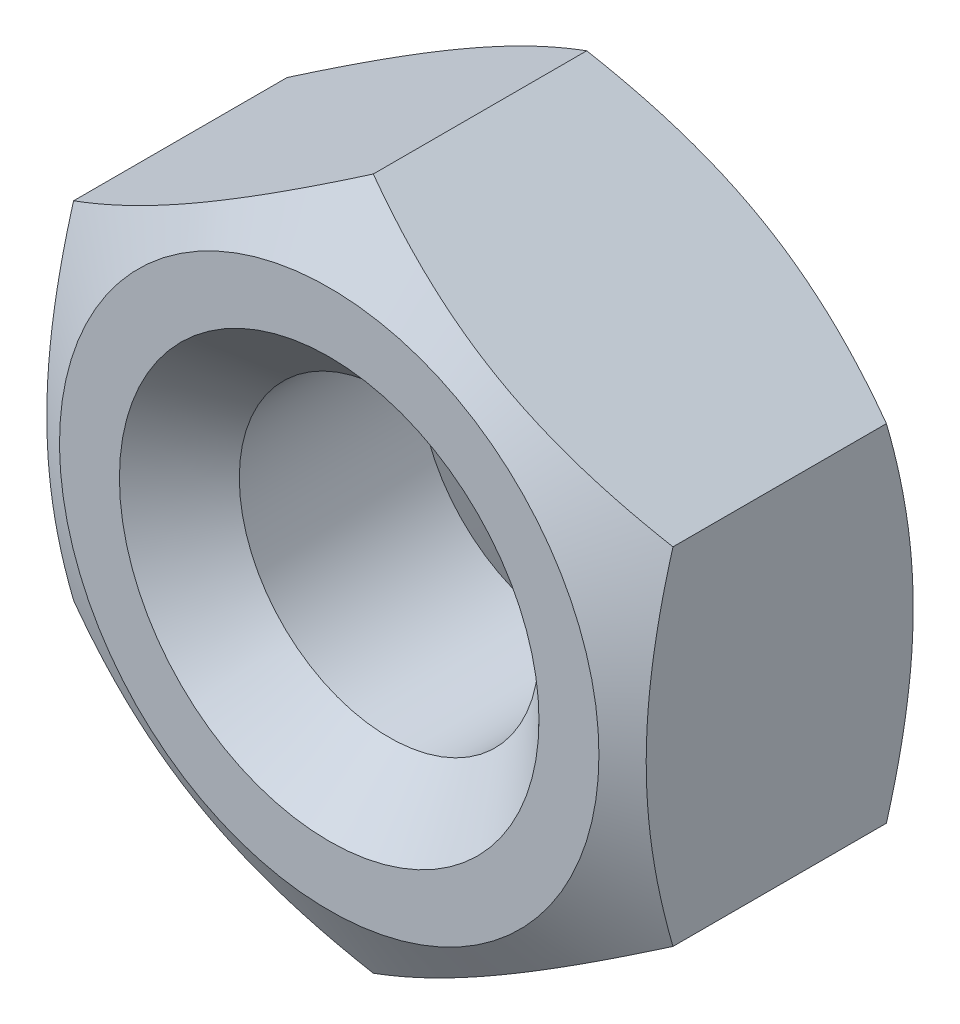
ISO-10303-21;
HEADER;
FILE_DESCRIPTION(('STEP AP214'),'2;1');
FILE_NAME('part.step','',(''),(''),'','','');
FILE_SCHEMA(('AUTOMOTIVE_DESIGN { 1 0 10303 214 1 1 1 1 }'));
ENDSEC;
DATA;
#1=APPLICATION_CONTEXT('core data for automotive mechanical design processes');
#2=APPLICATION_PROTOCOL_DEFINITION('international standard','automotive_design',2000,#1);
#3=PRODUCT_CONTEXT('',#1,'mechanical');
#4=PRODUCT('Part','Part','',(#3));
#5=PRODUCT_RELATED_PRODUCT_CATEGORY('part','',(#4));
#6=PRODUCT_DEFINITION_FORMATION('','',#4);
#7=PRODUCT_DEFINITION_CONTEXT('part definition',#1,'design');
#8=PRODUCT_DEFINITION('design','',#6,#7);
#9=PRODUCT_DEFINITION_SHAPE('','',#8);
#10=(LENGTH_UNIT() NAMED_UNIT(*) SI_UNIT(.MILLI.,.METRE.));
#11=(NAMED_UNIT(*) PLANE_ANGLE_UNIT() SI_UNIT($,.RADIAN.));
#12=(NAMED_UNIT(*) SI_UNIT($,.STERADIAN.) SOLID_ANGLE_UNIT());
#13=UNCERTAINTY_MEASURE_WITH_UNIT(LENGTH_MEASURE(1.E-05),#10,'distance_accuracy_value','');
#14=(GEOMETRIC_REPRESENTATION_CONTEXT(3) GLOBAL_UNCERTAINTY_ASSIGNED_CONTEXT((#13)) GLOBAL_UNIT_ASSIGNED_CONTEXT((#10,
#11,#12)) REPRESENTATION_CONTEXT('',''));
#15=CARTESIAN_POINT('',(0.,0.,0.));
#16=DIRECTION('',(0.,0.,1.));
#17=DIRECTION('',(1.,0.,0.));
#18=AXIS2_PLACEMENT_3D('',#15,#16,#17);
#19=CARTESIAN_POINT('',(0.,0.,0.));
#20=DIRECTION('',(0.,0.,-1.));
#21=DIRECTION('',(-1.,0.,0.));
#22=AXIS2_PLACEMENT_3D('',#19,#20,#21);
#23=PLANE('',#22);
#24=CARTESIAN_POINT('',(0.,0.,0.));
#25=DIRECTION('',(0.,0.,-1.));
#26=DIRECTION('',(-1.,0.,0.));
#27=AXIS2_PLACEMENT_3D('',#24,#25,#26);
#28=CIRCLE('',#27,1.4);
#29=CARTESIAN_POINT('',(-1.4,0.,0.));
#30=VERTEX_POINT('',#29);
#31=EDGE_CURVE('E110',#30,#30,#28,.T.);
#32=ORIENTED_EDGE('',*,*,#31,.T.);
#33=EDGE_LOOP('',(#32));
#34=FACE_BOUND('',#33,.T.);
#35=CARTESIAN_POINT('',(0.,0.,0.));
#36=DIRECTION('',(0.,0.,1.));
#37=DIRECTION('',(1.,0.,0.));
#38=AXIS2_PLACEMENT_3D('',#35,#36,#37);
#39=CIRCLE('',#38,1.8);
#40=CARTESIAN_POINT('',(1.8,0.,0.));
#41=VERTEX_POINT('',#40);
#42=EDGE_CURVE('E134',#41,#41,#39,.T.);
#43=ORIENTED_EDGE('',*,*,#42,.T.);
#44=EDGE_LOOP('',(#43));
#45=FACE_BOUND('',#44,.T.);
#46=ADVANCED_FACE('F36',(#34,#45),#23,.F.);
#47=CARTESIAN_POINT('',(0.,0.,-2.));
#48=DIRECTION('',(0.,0.,1.));
#49=DIRECTION('',(1.,0.,0.));
#50=AXIS2_PLACEMENT_3D('',#47,#48,#49);
#51=PLANE('',#50);
#52=CARTESIAN_POINT('',(0.,0.,-2.));
#53=DIRECTION('',(0.,0.,1.));
#54=DIRECTION('',(1.,0.,0.));
#55=AXIS2_PLACEMENT_3D('',#52,#53,#54);
#56=CIRCLE('',#55,1.4);
#57=CARTESIAN_POINT('',(1.4,0.,-2.));
#58=VERTEX_POINT('',#57);
#59=EDGE_CURVE('E12',#58,#58,#56,.T.);
#60=ORIENTED_EDGE('',*,*,#59,.T.);
#61=EDGE_LOOP('',(#60));
#62=FACE_BOUND('',#61,.T.);
#63=CARTESIAN_POINT('',(0.,0.,-2.));
#64=DIRECTION('',(0.,0.,1.));
#65=DIRECTION('',(1.,0.,0.));
#66=AXIS2_PLACEMENT_3D('',#63,#64,#65);
#67=CIRCLE('',#66,1.82171423220702);
#68=CARTESIAN_POINT('',(1.82171423220702,0.,-2.));
#69=VERTEX_POINT('',#68);
#70=EDGE_CURVE('E96',#69,#69,#67,.T.);
#71=ORIENTED_EDGE('',*,*,#70,.F.);
#72=EDGE_LOOP('',(#71));
#73=FACE_BOUND('',#72,.T.);
#74=ADVANCED_FACE('F227',(#62,#73),#51,.F.);
#75=CARTESIAN_POINT('',(0.,0.,-2.));
#76=DIRECTION('',(0.,0.,1.));
#77=DIRECTION('',(1.,0.,0.));
#78=AXIS2_PLACEMENT_3D('',#75,#76,#77);
#79=CYLINDRICAL_SURFACE('',#78,1.);
#80=CARTESIAN_POINT('',(0.,0.,-0.400000000000001));
#81=DIRECTION('',(0.,0.,-1.));
#82=DIRECTION('',(-1.,0.,0.));
#83=AXIS2_PLACEMENT_3D('',#80,#81,#82);
#84=CIRCLE('',#83,1.);
#85=CARTESIAN_POINT('',(-1.,0.,-0.400000000000001));
#86=VERTEX_POINT('',#85);
#87=EDGE_CURVE('E44',#86,#86,#84,.F.);
#88=ORIENTED_EDGE('',*,*,#87,.T.);
#89=EDGE_LOOP('',(#88));
#90=FACE_BOUND('',#89,.T.);
#91=CARTESIAN_POINT('',(0.,0.,-1.6));
#92=DIRECTION('',(0.,0.,1.));
#93=DIRECTION('',(1.,0.,0.));
#94=AXIS2_PLACEMENT_3D('',#91,#92,#93);
#95=CIRCLE('',#94,1.);
#96=CARTESIAN_POINT('',(1.,0.,-1.6));
#97=VERTEX_POINT('',#96);
#98=EDGE_CURVE('E252',#97,#97,#95,.F.);
#99=ORIENTED_EDGE('',*,*,#98,.T.);
#100=EDGE_LOOP('',(#99));
#101=FACE_BOUND('',#100,.T.);
#102=ADVANCED_FACE('F224',(#90,#101),#79,.F.);
#103=CARTESIAN_POINT('',(0.,0.,-1.71411308176974));
#104=DIRECTION('',(0.,0.,1.));
#105=DIRECTION('',(1.,0.,0.));
#106=AXIS2_PLACEMENT_3D('',#103,#104,#105);
#107=CONICAL_SURFACE('',#106,2.31688489980112,1.0471975511966);
#108=CARTESIAN_POINT('',(-0.000199999999999981,-2.30951654681234,-1.71836719735155));
#109=CARTESIAN_POINT('',(0.08769126290006,-2.25877250251758,-1.74767712787136));
#110=CARTESIAN_POINT('',(0.176341194473591,-2.20759044065996,-1.77433381199158));
#111=CARTESIAN_POINT('',(0.355176246997802,-2.10433997494456,-1.82086417295132));
#112=CARTESIAN_POINT('',(0.445364546505037,-2.05226973594631,-1.84072138758926));
#113=CARTESIAN_POINT('',(0.624623385763306,-1.94877459684592,-1.87163319994879));
#114=CARTESIAN_POINT('',(0.713666338226304,-1.89736562427197,-1.88289351237351));
#115=CARTESIAN_POINT('',(0.892171397785043,-1.79430568008402,-1.8963380013774));
#116=CARTESIAN_POINT('',(0.981632855703959,-1.74265508327244,-1.89853330901858));
#117=CARTESIAN_POINT('',(1.1488083535488,-1.64613626458981,-1.8939756746414));
#118=CARTESIAN_POINT('',(1.22654737026578,-1.60125362236173,-1.88834178928503));
#119=CARTESIAN_POINT('',(1.38151891453613,-1.51178075956051,-1.87048276871122));
#120=CARTESIAN_POINT('',(1.4587509057412,-1.46719084864821,-1.8582515279486));
#121=CARTESIAN_POINT('',(1.6140421864822,-1.37753338590959,-1.82767322710443));
#122=CARTESIAN_POINT('',(1.69208181310738,-1.33247718647009,-1.80919649690633));
#123=CARTESIAN_POINT('',(1.84699686569213,-1.24303693915875,-1.76726114575919));
#124=CARTESIAN_POINT('',(1.92387427762312,-1.1986517446858,-1.74381238347973));
#125=CARTESIAN_POINT('',(2.0002,-1.15458506832541,-1.71836719735155));
#126=B_SPLINE_CURVE_WITH_KNOTS('',3,(#108,#109,#110,#111,#112,#113,#114,#115,#116,#117,#118,
#119,#120,#121,#122,#123,#124,#125),.UNSPECIFIED.,.F.,.F.,(4,2,2,2,2,2,2,2,4),(0.,
0.31703182469561,0.634825876346564,0.944753967652636,1.25430138000371,1.52387047293094,
1.79368946861028,2.06949491027634,2.34475850821472),.UNSPECIFIED.);
#127=CARTESIAN_POINT('',(0.,-2.3094010767585,-1.71843386901796));
#128=VERTEX_POINT('',#127);
#129=CARTESIAN_POINT('',(2.,-1.15470053837925,-1.71843386901796));
#130=VERTEX_POINT('',#129);
#131=EDGE_CURVE('E86',#128,#130,#126,.T.);
#132=ORIENTED_EDGE('',*,*,#131,.F.);
#133=CARTESIAN_POINT('',(-2.0002,-1.15458506832541,-1.71836719735155));
#134=CARTESIAN_POINT('',(-1.91230873709994,-1.20532911262018,-1.74767712787136));
#135=CARTESIAN_POINT('',(-1.82365880552641,-1.2565111744778,-1.77433381199158));
#136=CARTESIAN_POINT('',(-1.6448237530022,-1.35976164019319,-1.82086417295132));
#137=CARTESIAN_POINT('',(-1.55463545349496,-1.41183187919145,-1.84072138758926));
#138=CARTESIAN_POINT('',(-1.37537661423669,-1.51532701829183,-1.87163319994879));
#139=CARTESIAN_POINT('',(-1.2863336617737,-1.56673599086578,-1.88289351237351));
#140=CARTESIAN_POINT('',(-1.10782860221496,-1.66979593505373,-1.8963380013774));
#141=CARTESIAN_POINT('',(-1.01836714429604,-1.72144653186531,-1.89853330901858));
#142=CARTESIAN_POINT('',(-0.851191646451202,-1.81796535054794,-1.8939756746414));
#143=CARTESIAN_POINT('',(-0.773452629734216,-1.86284799277603,-1.88834178928503));
#144=CARTESIAN_POINT('',(-0.618481085463867,-1.95232085557725,-1.87048276871122));
#145=CARTESIAN_POINT('',(-0.541249094258802,-1.99691076648954,-1.8582515279486));
#146=CARTESIAN_POINT('',(-0.385957813517799,-2.08656822922816,-1.82767322710443));
#147=CARTESIAN_POINT('',(-0.30791818689262,-2.13162442866767,-1.80919649690633));
#148=CARTESIAN_POINT('',(-0.153003134307865,-2.221064675979,-1.76726114575919));
#149=CARTESIAN_POINT('',(-0.07612572237688,-2.26544987045196,-1.74381238347973));
#150=CARTESIAN_POINT('',(0.00020000000000012,-2.30951654681234,-1.71836719735155));
#151=B_SPLINE_CURVE_WITH_KNOTS('',3,(#133,#134,#135,#136,#137,#138,#139,#140,#141,#142,#143,
#144,#145,#146,#147,#148,#149,#150),.UNSPECIFIED.,.F.,.F.,(4,2,2,2,2,2,2,2,4),(0.,
0.31703182469561,0.634825876346564,0.944753967652636,1.25430138000371,1.52387047293094,
1.79368946861028,2.06949491027634,2.34475850821472),.UNSPECIFIED.);
#152=CARTESIAN_POINT('',(-2.,-1.15470053837925,-1.71843386901796));
#153=VERTEX_POINT('',#152);
#154=EDGE_CURVE('E90',#153,#128,#151,.T.);
#155=ORIENTED_EDGE('',*,*,#154,.F.);
#156=CARTESIAN_POINT('',(-2.,-3.04877948093373,-0.946610333820865));
#157=CARTESIAN_POINT('',(-2.,-2.96185159302541,-0.988562645387252));
#158=CARTESIAN_POINT('',(-2.,-2.87471836280849,-1.03009706688648));
#159=CARTESIAN_POINT('',(-2.,-2.69993179487877,-1.11209394762808));
#160=CARTESIAN_POINT('',(-2.,-2.61227837269937,-1.15255622660877));
#161=CARTESIAN_POINT('',(-2.,-2.43586446250616,-1.2323876711059));
#162=CARTESIAN_POINT('',(-2.,-2.34710050602697,-1.27174919950666));
#163=CARTESIAN_POINT('',(-2.,-2.16884774611023,-1.34878895599142));
#164=CARTESIAN_POINT('',(-2.,-2.07935897883648,-1.38646726745433));
#165=CARTESIAN_POINT('',(-2.,-1.89684612368223,-1.46078073979269));
#166=CARTESIAN_POINT('',(-2.,-1.80379584053042,-1.49735193001217));
#167=CARTESIAN_POINT('',(-2.,-1.61658729640833,-1.56759613655673));
#168=CARTESIAN_POINT('',(-2.,-1.52242890974947,-1.60126882044102));
#169=CARTESIAN_POINT('',(-2.,-1.33305239823237,-1.66479173891702));
#170=CARTESIAN_POINT('',(-2.,-1.23783711186187,-1.69465034756398));
#171=CARTESIAN_POINT('',(-2.,-1.04603435310176,-1.74955651897636));
#172=CARTESIAN_POINT('',(-2.,-0.949447219988647,-1.7746052497828));
#173=CARTESIAN_POINT('',(-2.,-0.755378801303309,-1.81852205456775));
#174=CARTESIAN_POINT('',(-2.,-0.657904763924989,-1.83742154973516));
#175=CARTESIAN_POINT('',(-2.,-0.461802968613701,-1.86793678414789));
#176=CARTESIAN_POINT('',(-2.,-0.363175303970167,-1.87955310826374));
#177=CARTESIAN_POINT('',(-2.,-0.166520324172816,-1.89441942436761));
#178=CARTESIAN_POINT('',(-2.,-0.0685010507901018,-1.89777276508989));
#179=CARTESIAN_POINT('',(-2.,0.127462263079516,-1.89610968722588));
#180=CARTESIAN_POINT('',(-2.,0.225406300837787,-1.89109297820224));
#181=CARTESIAN_POINT('',(-2.,0.463635287558364,-1.86915306792847));
#182=CARTESIAN_POINT('',(-2.,0.603527867989527,-1.84795196594647));
#183=CARTESIAN_POINT('',(-2.,0.880665760437669,-1.79233049354238));
#184=CARTESIAN_POINT('',(-2.,1.01790818531803,-1.75789647574453));
#185=CARTESIAN_POINT('',(-2.,1.29251747186684,-1.6786758790534));
#186=CARTESIAN_POINT('',(-2.,1.42982276293823,-1.63368140465588));
#187=CARTESIAN_POINT('',(-2.,1.70189717318541,-1.53684147910921));
#188=CARTESIAN_POINT('',(-2.,1.8366670790957,-1.48499819459513));
#189=CARTESIAN_POINT('',(-2.,2.14157601730041,-1.36145713939248));
#190=CARTESIAN_POINT('',(-2.,2.31109893174722,-1.28825401541372));
#191=CARTESIAN_POINT('',(-2.,2.64792466737481,-1.13687878574264));
#192=CARTESIAN_POINT('',(-2.,2.81522699494853,-1.05870559691183));
#193=CARTESIAN_POINT('',(-2.,3.14837482364043,-0.898965541238145));
#194=CARTESIAN_POINT('',(-2.,3.31421892978584,-0.817395779382536));
#195=CARTESIAN_POINT('',(-2.,3.64475106371024,-0.651944579241605));
#196=CARTESIAN_POINT('',(-2.,3.80943905699779,-0.568063072352403));
#197=CARTESIAN_POINT('',(-2.,4.12519667487026,-0.405220881919118));
#198=CARTESIAN_POINT('',(-2.,4.27633037467361,-0.326384133779491));
#199=CARTESIAN_POINT('',(-2.,4.57803864607621,-0.167638980395725));
#200=CARTESIAN_POINT('',(-2.,4.72861320162548,-0.087730544688302));
#201=CARTESIAN_POINT('',(-2.,5.02899932412339,0.0727373508397198));
#202=CARTESIAN_POINT('',(-2.,5.17881183492632,0.153295046204304));
#203=CARTESIAN_POINT('',(-2.,5.47807583326341,0.315061569844154));
#204=CARTESIAN_POINT('',(-2.,5.62752733765088,0.396270366927683));
#205=CARTESIAN_POINT('',(-2.,5.77684422474792,0.477724224516672));
#206=B_SPLINE_CURVE_WITH_KNOTS('',3,(#156,#157,#158,#159,#160,#161,#162,#163,#164,#165,#166,
#167,#168,#169,#170,#171,#172,#173,#174,#175,#176,#177,#178,#179,#180,#181,#182,#183,#184,#185,
#186,#187,#188,#189,#190,#191,#192,#193,#194,#195,#196,#197,#198,#199,#200,#201,#202,#203,#204,
#205),.UNSPECIFIED.,.F.,.F.,(4,2,2,2,2,2,2,2,2,2,2,2,2,2,2,2,2,2,2,2,2,2,2,2,4),(0.,
0.289569150407998,0.579186681700231,0.870472101785877,1.16174307688205,1.46164289263703,
1.76157705934612,2.06084094803636,2.36003207067926,2.65766946686969,2.95528295841164,
3.24915473419224,3.54303670741721,3.96663033727491,4.39066200536735,4.82386929648856,
5.2569398683205,5.8107662015206,6.36471364795495,6.91914331471273,7.47358945260821,
7.98496425619282,8.49635362681464,9.00664588787394,9.51691384718108),.UNSPECIFIED.);
#207=CARTESIAN_POINT('',(-2.,1.15470053837925,-1.71843386901796));
#208=VERTEX_POINT('',#207);
#209=EDGE_CURVE('E105',#208,#153,#206,.F.);
#210=ORIENTED_EDGE('',*,*,#209,.F.);
#211=CARTESIAN_POINT('',(0.000199999999999994,2.30951654681234,-1.71836719735155));
#212=CARTESIAN_POINT('',(-0.0876912629000599,2.25877250251758,-1.74767712787136));
#213=CARTESIAN_POINT('',(-0.176341194473591,2.20759044065996,-1.77433381199158));
#214=CARTESIAN_POINT('',(-0.355176246997802,2.10433997494456,-1.82086417295132));
#215=CARTESIAN_POINT('',(-0.445364546505037,2.05226973594631,-1.84072138758926));
#216=CARTESIAN_POINT('',(-0.624623385763306,1.94877459684592,-1.87163319994879));
#217=CARTESIAN_POINT('',(-0.713666338226304,1.89736562427197,-1.88289351237351));
#218=CARTESIAN_POINT('',(-0.892171397785043,1.79430568008402,-1.8963380013774));
#219=CARTESIAN_POINT('',(-0.981632855703959,1.74265508327244,-1.89853330901858));
#220=CARTESIAN_POINT('',(-1.1488083535488,1.64613626458981,-1.8939756746414));
#221=CARTESIAN_POINT('',(-1.22654737026578,1.60125362236173,-1.88834178928503));
#222=CARTESIAN_POINT('',(-1.38151891453613,1.51178075956051,-1.87048276871122));
#223=CARTESIAN_POINT('',(-1.4587509057412,1.46719084864821,-1.8582515279486));
#224=CARTESIAN_POINT('',(-1.6140421864822,1.37753338590959,-1.82767322710443));
#225=CARTESIAN_POINT('',(-1.69208181310738,1.33247718647009,-1.80919649690633));
#226=CARTESIAN_POINT('',(-1.84699686569213,1.24303693915875,-1.76726114575919));
#227=CARTESIAN_POINT('',(-1.92387427762312,1.1986517446858,-1.74381238347973));
#228=CARTESIAN_POINT('',(-2.0002,1.15458506832541,-1.71836719735155));
#229=B_SPLINE_CURVE_WITH_KNOTS('',3,(#211,#212,#213,#214,#215,#216,#217,#218,#219,#220,#221,
#222,#223,#224,#225,#226,#227,#228),.UNSPECIFIED.,.F.,.F.,(4,2,2,2,2,2,2,2,4),(0.,
0.31703182469561,0.634825876346564,0.944753967652636,1.25430138000371,1.52387047293094,
1.79368946861028,2.06949491027634,2.34475850821472),.UNSPECIFIED.);
#230=CARTESIAN_POINT('',(0.,2.3094010767585,-1.71843386901796));
#231=VERTEX_POINT('',#230);
#232=EDGE_CURVE('E195',#231,#208,#229,.T.);
#233=ORIENTED_EDGE('',*,*,#232,.F.);
#234=CARTESIAN_POINT('',(2.0002,1.15458506832541,-1.71836719735155));
#235=CARTESIAN_POINT('',(1.91230873709994,1.20532911262018,-1.74767712787137));
#236=CARTESIAN_POINT('',(1.82365880552641,1.2565111744778,-1.77433381199158));
#237=CARTESIAN_POINT('',(1.6448237530022,1.35976164019319,-1.82086417295132));
#238=CARTESIAN_POINT('',(1.55463545349496,1.41183187919145,-1.84072138758926));
#239=CARTESIAN_POINT('',(1.37537661423669,1.51532701829183,-1.87163319994879));
#240=CARTESIAN_POINT('',(1.2863336617737,1.56673599086578,-1.88289351237351));
#241=CARTESIAN_POINT('',(1.10782860221496,1.66979593505373,-1.8963380013774));
#242=CARTESIAN_POINT('',(1.01836714429604,1.72144653186531,-1.89853330901858));
#243=CARTESIAN_POINT('',(0.851191646451202,1.81796535054794,-1.8939756746414));
#244=CARTESIAN_POINT('',(0.773452629734216,1.86284799277603,-1.88834178928503));
#245=CARTESIAN_POINT('',(0.618481085463867,1.95232085557725,-1.87048276871122));
#246=CARTESIAN_POINT('',(0.541249094258802,1.99691076648954,-1.8582515279486));
#247=CARTESIAN_POINT('',(0.385957813517799,2.08656822922816,-1.82767322710443));
#248=CARTESIAN_POINT('',(0.30791818689262,2.13162442866767,-1.80919649690633));
#249=CARTESIAN_POINT('',(0.153003134307865,2.221064675979,-1.76726114575919));
#250=CARTESIAN_POINT('',(0.0761257223768801,2.26544987045196,-1.74381238347973));
#251=CARTESIAN_POINT('',(-0.000200000000000136,2.30951654681234,-1.71836719735155));
#252=B_SPLINE_CURVE_WITH_KNOTS('',3,(#234,#235,#236,#237,#238,#239,#240,#241,#242,#243,#244,
#245,#246,#247,#248,#249,#250,#251),.UNSPECIFIED.,.F.,.F.,(4,2,2,2,2,2,2,2,4),(0.,
0.31703182469561,0.634825876346564,0.944753967652636,1.25430138000371,1.52387047293094,
1.79368946861028,2.06949491027634,2.34475850821472),.UNSPECIFIED.);
#253=CARTESIAN_POINT('',(2.,1.15470053837925,-1.71843386901796));
#254=VERTEX_POINT('',#253);
#255=EDGE_CURVE('E189',#254,#231,#252,.T.);
#256=ORIENTED_EDGE('',*,*,#255,.F.);
#257=CARTESIAN_POINT('',(2.,-3.04877948093373,-0.946610333820865));
#258=CARTESIAN_POINT('',(2.,-2.96185159302541,-0.988562645387251));
#259=CARTESIAN_POINT('',(2.,-2.87471836280849,-1.03009706688648));
#260=CARTESIAN_POINT('',(2.,-2.69993179487877,-1.11209394762808));
#261=CARTESIAN_POINT('',(2.,-2.61227837269937,-1.15255622660877));
#262=CARTESIAN_POINT('',(2.,-2.43586446250616,-1.2323876711059));
#263=CARTESIAN_POINT('',(2.,-2.34710050602697,-1.27174919950666));
#264=CARTESIAN_POINT('',(2.,-2.16884774611023,-1.34878895599142));
#265=CARTESIAN_POINT('',(2.,-2.07935897883648,-1.38646726745433));
#266=CARTESIAN_POINT('',(2.,-1.89684612368223,-1.46078073979269));
#267=CARTESIAN_POINT('',(2.,-1.80379584053042,-1.49735193001217));
#268=CARTESIAN_POINT('',(2.,-1.61658729640833,-1.56759613655673));
#269=CARTESIAN_POINT('',(2.,-1.52242890974947,-1.60126882044102));
#270=CARTESIAN_POINT('',(2.,-1.33305239823237,-1.66479173891701));
#271=CARTESIAN_POINT('',(2.,-1.23783711186187,-1.69465034756398));
#272=CARTESIAN_POINT('',(2.,-1.04603435310176,-1.74955651897636));
#273=CARTESIAN_POINT('',(2.,-0.949447219988648,-1.7746052497828));
#274=CARTESIAN_POINT('',(2.,-0.755378801303309,-1.81852205456775));
#275=CARTESIAN_POINT('',(2.,-0.657904763924989,-1.83742154973516));
#276=CARTESIAN_POINT('',(2.,-0.461802968613701,-1.86793678414789));
#277=CARTESIAN_POINT('',(2.,-0.363175303970167,-1.87955310826374));
#278=CARTESIAN_POINT('',(2.,-0.166520324172817,-1.89441942436761));
#279=CARTESIAN_POINT('',(2.,-0.0685010507901021,-1.89777276508989));
#280=CARTESIAN_POINT('',(2.,0.127462263079515,-1.89610968722588));
#281=CARTESIAN_POINT('',(2.,0.225406300837787,-1.89109297820224));
#282=CARTESIAN_POINT('',(2.,0.463635287558363,-1.86915306792847));
#283=CARTESIAN_POINT('',(2.,0.603527867989526,-1.84795196594647));
#284=CARTESIAN_POINT('',(2.,0.880665760437668,-1.79233049354238));
#285=CARTESIAN_POINT('',(2.,1.01790818531803,-1.75789647574453));
#286=CARTESIAN_POINT('',(2.,1.29251747186684,-1.6786758790534));
#287=CARTESIAN_POINT('',(2.,1.42982276293823,-1.63368140465588));
#288=CARTESIAN_POINT('',(2.,1.70189717318541,-1.53684147910921));
#289=CARTESIAN_POINT('',(2.,1.8366670790957,-1.48499819459513));
#290=CARTESIAN_POINT('',(2.,2.14157601730041,-1.36145713939248));
#291=CARTESIAN_POINT('',(2.,2.31109893174722,-1.28825401541372));
#292=CARTESIAN_POINT('',(2.,2.64792466737481,-1.13687878574264));
#293=CARTESIAN_POINT('',(2.,2.81522699494853,-1.05870559691183));
#294=CARTESIAN_POINT('',(2.,3.14837482364043,-0.898965541238145));
#295=CARTESIAN_POINT('',(2.,3.31421892978584,-0.817395779382536));
#296=CARTESIAN_POINT('',(2.,3.64475106371024,-0.651944579241606));
#297=CARTESIAN_POINT('',(2.,3.80943905699779,-0.568063072352404));
#298=CARTESIAN_POINT('',(2.,4.12519667487026,-0.405220881919118));
#299=CARTESIAN_POINT('',(2.,4.27633037467361,-0.326384133779491));
#300=CARTESIAN_POINT('',(2.,4.57803864607621,-0.167638980395725));
#301=CARTESIAN_POINT('',(2.,4.72861320162548,-0.0877305446883022));
#302=CARTESIAN_POINT('',(2.,5.02899932412339,0.0727373508397197));
#303=CARTESIAN_POINT('',(2.,5.17881183492632,0.153295046204304));
#304=CARTESIAN_POINT('',(2.,5.47807583326341,0.315061569844154));
#305=CARTESIAN_POINT('',(2.,5.62752733765088,0.396270366927683));
#306=CARTESIAN_POINT('',(2.,5.77684422474792,0.477724224516671));
#307=B_SPLINE_CURVE_WITH_KNOTS('',3,(#257,#258,#259,#260,#261,#262,#263,#264,#265,#266,#267,
#268,#269,#270,#271,#272,#273,#274,#275,#276,#277,#278,#279,#280,#281,#282,#283,#284,#285,#286,
#287,#288,#289,#290,#291,#292,#293,#294,#295,#296,#297,#298,#299,#300,#301,#302,#303,#304,#305,
#306),.UNSPECIFIED.,.F.,.F.,(4,2,2,2,2,2,2,2,2,2,2,2,2,2,2,2,2,2,2,2,2,2,2,2,4),(0.,
0.289569150407999,0.579186681700233,0.870472101785878,1.16174307688205,1.46164289263703,
1.76157705934612,2.06084094803636,2.36003207067926,2.65766946686969,2.95528295841164,
3.24915473419224,3.54303670741721,3.96663033727491,4.39066200536735,4.82386929648856,
5.2569398683205,5.8107662015206,6.36471364795495,6.91914331471273,7.47358945260821,
7.98496425619282,8.49635362681464,9.00664588787394,9.51691384718108),.UNSPECIFIED.);
#308=EDGE_CURVE('E59',#130,#254,#307,.T.);
#309=ORIENTED_EDGE('',*,*,#308,.F.);
#310=EDGE_LOOP('',(#132,#155,#210,#233,#256,#309));
#311=FACE_BOUND('',#310,.T.);
#312=ORIENTED_EDGE('',*,*,#70,.T.);
#313=EDGE_LOOP('',(#312));
#314=FACE_BOUND('',#313,.T.);
#315=ADVANCED_FACE('F88',(#311,#314),#107,.T.);
#316=CARTESIAN_POINT('',(0.,-2.3094010767585,-16.2835569799683));
#317=DIRECTION('',(0.5,-0.866025403784438,0.));
#318=DIRECTION('',(0.866025403784439,0.5,0.));
#319=AXIS2_PLACEMENT_3D('',#316,#317,#318);
#320=PLANE('',#319);
#321=DIRECTION('',(0.,0.,1.));
#322=VECTOR('',#321,1.);
#323=CARTESIAN_POINT('',(2.,-1.15470053837925,-16.2835569799683));
#324=LINE('',#323,#322);
#325=CARTESIAN_POINT('',(2.,-1.15470053837925,-0.294102848792009));
#326=VERTEX_POINT('',#325);
#327=EDGE_CURVE('E131',#130,#326,#324,.T.);
#328=ORIENTED_EDGE('',*,*,#327,.T.);
#329=CARTESIAN_POINT('',(2.0002,-1.15458506832541,-0.294169520458425));
#330=CARTESIAN_POINT('',(1.91230873709994,-1.20532911262018,-0.264859589938606));
#331=CARTESIAN_POINT('',(1.82365880552641,-1.2565111744778,-0.238202905818393));
#332=CARTESIAN_POINT('',(1.6448237530022,-1.35976164019319,-0.191672544858648));
#333=CARTESIAN_POINT('',(1.55463545349496,-1.41183187919145,-0.171815330220706));
#334=CARTESIAN_POINT('',(1.37537661423669,-1.51532701829183,-0.140903517861179));
#335=CARTESIAN_POINT('',(1.2863336617737,-1.56673599086578,-0.129643205436457));
#336=CARTESIAN_POINT('',(1.10782860221496,-1.66979593505373,-0.116198716432568));
#337=CARTESIAN_POINT('',(1.01836714429604,-1.72144653186531,-0.114003408791394));
#338=CARTESIAN_POINT('',(0.851191646451201,-1.81796535054794,-0.118561043168575));
#339=CARTESIAN_POINT('',(0.773452629734216,-1.86284799277603,-0.124194928524941));
#340=CARTESIAN_POINT('',(0.618481085463866,-1.95232085557725,-0.142053949098755));
#341=CARTESIAN_POINT('',(0.541249094258801,-1.99691076648954,-0.154285189861366));
#342=CARTESIAN_POINT('',(0.385957813517799,-2.08656822922816,-0.184863490705537));
#343=CARTESIAN_POINT('',(0.30791818689262,-2.13162442866767,-0.203340220903643));
#344=CARTESIAN_POINT('',(0.153003134307865,-2.221064675979,-0.245275572050783));
#345=CARTESIAN_POINT('',(0.07612572237688,-2.26544987045196,-0.268724334330241));
#346=CARTESIAN_POINT('',(-0.000200000000000141,-2.30951654681234,-0.294169520458425));
#347=B_SPLINE_CURVE_WITH_KNOTS('',3,(#329,#330,#331,#332,#333,#334,#335,#336,#337,#338,#339,
#340,#341,#342,#343,#344,#345,#346),.UNSPECIFIED.,.F.,.F.,(4,2,2,2,2,2,2,2,4),(0.,
0.31703182469561,0.634825876346564,0.944753967652637,1.25430138000371,1.52387047293094,
1.79368946861028,2.06949491027634,2.34475850821472),.UNSPECIFIED.);
#348=CARTESIAN_POINT('',(0.,-2.3094010767585,-0.294102848792008));
#349=VERTEX_POINT('',#348);
#350=EDGE_CURVE('E108',#326,#349,#347,.T.);
#351=ORIENTED_EDGE('',*,*,#350,.T.);
#352=DIRECTION('',(0.,0.,1.));
#353=VECTOR('',#352,1.);
#354=CARTESIAN_POINT('',(0.,-2.3094010767585,-16.2835569799683));
#355=LINE('',#354,#353);
#356=EDGE_CURVE('E102',#128,#349,#355,.T.);
#357=ORIENTED_EDGE('',*,*,#356,.F.);
#358=ORIENTED_EDGE('',*,*,#131,.T.);
#359=EDGE_LOOP('',(#328,#351,#357,#358));
#360=FACE_BOUND('',#359,.T.);
#361=ADVANCED_FACE('F107',(#360),#320,.T.);
#362=CARTESIAN_POINT('',(-2.,-1.15470053837925,-16.2835569799683));
#363=DIRECTION('',(-0.5,-0.866025403784438,0.));
#364=DIRECTION('',(0.866025403784438,-0.5,0.));
#365=AXIS2_PLACEMENT_3D('',#362,#363,#364);
#366=PLANE('',#365);
#367=ORIENTED_EDGE('',*,*,#356,.T.);
#368=CARTESIAN_POINT('',(0.000200000000000057,-2.30951654681234,-0.294169520458425));
#369=CARTESIAN_POINT('',(-0.0876912629000601,-2.25877250251758,-0.264859589938606));
#370=CARTESIAN_POINT('',(-0.176341194473592,-2.20759044065996,-0.238202905818394));
#371=CARTESIAN_POINT('',(-0.355176246997802,-2.10433997494456,-0.191672544858648));
#372=CARTESIAN_POINT('',(-0.445364546505037,-2.05226973594631,-0.171815330220706));
#373=CARTESIAN_POINT('',(-0.624623385763306,-1.94877459684592,-0.140903517861179));
#374=CARTESIAN_POINT('',(-0.713666338226304,-1.89736562427197,-0.129643205436457));
#375=CARTESIAN_POINT('',(-0.892171397785044,-1.79430568008402,-0.116198716432568));
#376=CARTESIAN_POINT('',(-0.981632855703959,-1.74265508327244,-0.114003408791394));
#377=CARTESIAN_POINT('',(-1.1488083535488,-1.64613626458981,-0.118561043168575));
#378=CARTESIAN_POINT('',(-1.22654737026578,-1.60125362236173,-0.124194928524941));
#379=CARTESIAN_POINT('',(-1.38151891453613,-1.51178075956051,-0.142053949098755));
#380=CARTESIAN_POINT('',(-1.4587509057412,-1.46719084864821,-0.154285189861366));
#381=CARTESIAN_POINT('',(-1.6140421864822,-1.37753338590959,-0.184863490705536));
#382=CARTESIAN_POINT('',(-1.69208181310738,-1.33247718647009,-0.203340220903643));
#383=CARTESIAN_POINT('',(-1.84699686569214,-1.24303693915875,-0.245275572050783));
#384=CARTESIAN_POINT('',(-1.92387427762312,-1.1986517446858,-0.26872433433024));
#385=CARTESIAN_POINT('',(-2.0002,-1.15458506832541,-0.294169520458425));
#386=B_SPLINE_CURVE_WITH_KNOTS('',3,(#368,#369,#370,#371,#372,#373,#374,#375,#376,#377,#378,
#379,#380,#381,#382,#383,#384,#385),.UNSPECIFIED.,.F.,.F.,(4,2,2,2,2,2,2,2,4),(0.,
0.317031824695611,0.634825876346564,0.944753967652637,1.25430138000371,1.52387047293094,
1.79368946861028,2.06949491027634,2.34475850821472),.UNSPECIFIED.);
#387=CARTESIAN_POINT('',(-2.,-1.15470053837925,-0.294102848792009));
#388=VERTEX_POINT('',#387);
#389=EDGE_CURVE('E51',#349,#388,#386,.T.);
#390=ORIENTED_EDGE('',*,*,#389,.T.);
#391=DIRECTION('',(0.,0.,1.));
#392=VECTOR('',#391,1.);
#393=CARTESIAN_POINT('',(-2.,-1.15470053837925,-16.2835569799683));
#394=LINE('',#393,#392);
#395=EDGE_CURVE('E104',#153,#388,#394,.T.);
#396=ORIENTED_EDGE('',*,*,#395,.F.);
#397=ORIENTED_EDGE('',*,*,#154,.T.);
#398=EDGE_LOOP('',(#367,#390,#396,#397));
#399=FACE_BOUND('',#398,.T.);
#400=ADVANCED_FACE('F101',(#399),#366,.T.);
#401=CARTESIAN_POINT('',(-2.,1.15470053837925,-16.2835569799683));
#402=DIRECTION('',(-1.,0.,0.));
#403=DIRECTION('',(0.,0.,1.));
#404=AXIS2_PLACEMENT_3D('',#401,#402,#403);
#405=PLANE('',#404);
#406=ORIENTED_EDGE('',*,*,#395,.T.);
#407=CARTESIAN_POINT('',(-2.,-3.04644918587816,-1.0648015686158));
#408=CARTESIAN_POINT('',(-2.,-2.95953904601889,-1.02286749754111));
#409=CARTESIAN_POINT('',(-2.,-2.87242334393839,-0.981351846541816));
#410=CARTESIAN_POINT('',(-2.,-2.69767126438804,-0.899393920158439));
#411=CARTESIAN_POINT('',(-2.,-2.6100348021175,-0.858951825799717));
#412=CARTESIAN_POINT('',(-2.,-2.43365303696367,-0.779162107237112));
#413=CARTESIAN_POINT('',(-2.,-2.3449042534324,-0.739822149532129));
#414=CARTESIAN_POINT('',(-2.,-2.1666811127162,-0.662827935631324));
#415=CARTESIAN_POINT('',(-2.,-2.07720679180848,-0.625173595760207));
#416=CARTESIAN_POINT('',(-2.,-1.89473333996678,-0.55091633747785));
#417=CARTESIAN_POINT('',(-2.,-1.80170809854025,-0.51437721658292));
#418=CARTESIAN_POINT('',(-2.,-1.61454909016802,-0.444200568275799));
#419=CARTESIAN_POINT('',(-2.,-1.52041519736063,-0.410563373990232));
#420=CARTESIAN_POINT('',(-2.,-1.3310879414475,-0.347115646371497));
#421=CARTESIAN_POINT('',(-2.,-1.23589742485733,-0.317296707673951));
#422=CARTESIAN_POINT('',(-2.,-1.04414468278578,-0.262474317747665));
#423=CARTESIAN_POINT('',(-2.,-0.947582796955081,-0.237469695730963));
#424=CARTESIAN_POINT('',(-2.,-0.753564231539425,-0.193644390860172));
#425=CARTESIAN_POINT('',(-2.,-0.656114761623695,-0.174792397273298));
#426=CARTESIAN_POINT('',(-2.,-0.460065049990544,-0.144374445012085));
#427=CARTESIAN_POINT('',(-2.,-0.361464900551866,-0.132807906115051));
#428=CARTESIAN_POINT('',(-2.,-0.164866340466992,-0.118038795442076));
#429=CARTESIAN_POINT('',(-2.,-0.0668759046060335,-0.114733091271937));
#430=CARTESIAN_POINT('',(-2.,0.129025903765497,-0.11648576026295));
#431=CARTESIAN_POINT('',(-2.,0.226937273344555,-0.121544430476779));
#432=CARTESIAN_POINT('',(-2.,0.465234439014431,-0.143589658759549));
#433=CARTESIAN_POINT('',(-2.,0.605224880667761,-0.164866926296966));
#434=CARTESIAN_POINT('',(-2.,0.882552124475529,-0.220644515589628));
#435=CARTESIAN_POINT('',(-2.,1.01988602661862,-0.255158516232055));
#436=CARTESIAN_POINT('',(-2.,1.29467663478691,-0.334538014552695));
#437=CARTESIAN_POINT('',(-2.,1.4320717198486,-0.379611304944681));
#438=CARTESIAN_POINT('',(-2.,1.70432475102646,-0.476604471936496));
#439=CARTESIAN_POINT('',(-2.,1.83918348848225,-0.528522171188578));
#440=CARTESIAN_POINT('',(-2.,2.14436731782863,-0.652257480114297));
#441=CARTESIAN_POINT('',(-2.,2.31407507283623,-0.725582436831822));
#442=CARTESIAN_POINT('',(-2.,2.65127008403388,-0.87719970573272));
#443=CARTESIAN_POINT('',(-2.,2.81875684750025,-0.95549309858341));
#444=CARTESIAN_POINT('',(-2.,3.15227371929664,-1.11547183856097));
#445=CARTESIAN_POINT('',(-2.,3.31830243495347,-1.19716007484339));
#446=CARTESIAN_POINT('',(-2.,3.64920420202902,-1.36284668928586));
#447=CARTESIAN_POINT('',(-2.,3.81407721906978,-1.44684513580369));
#448=CARTESIAN_POINT('',(-2.,4.13019023255079,-1.60991054686006));
#449=CARTESIAN_POINT('',(-2.,4.28149427437335,-1.68885366341573));
#450=CARTESIAN_POINT('',(-2.,4.58354358305795,-1.84781066185136));
#451=CARTESIAN_POINT('',(-2.,4.73428883390793,-1.92782457411649));
#452=CARTESIAN_POINT('',(-2.,5.03501702579822,-2.0885028591063));
#453=CARTESIAN_POINT('',(-2.,5.18500090788699,-2.16916547291826));
#454=CARTESIAN_POINT('',(-2.,5.48460792843174,-2.33114124183203));
#455=CARTESIAN_POINT('',(-2.,5.63423108368589,-2.41245436584874));
#456=CARTESIAN_POINT('',(-2.,5.78371973678662,-2.4940123127435));
#457=B_SPLINE_CURVE_WITH_KNOTS('',3,(#407,#408,#409,#410,#411,#412,#413,#414,#415,#416,#417,
#418,#419,#420,#421,#422,#423,#424,#425,#426,#427,#428,#429,#430,#431,#432,#433,#434,#435,#436,
#437,#438,#439,#440,#441,#442,#443,#444,#445,#446,#447,#448,#449,#450,#451,#452,#453,#454,#455,
#456),.UNSPECIFIED.,.F.,.F.,(4,2,2,2,2,2,2,2,2,2,2,2,2,2,2,2,2,2,2,2,2,2,2,2,4),(0.,
0.289497427132129,0.579043363767494,0.870260902431166,1.16146396877743,1.46125858374971,
1.76108756797386,2.06024473773645,2.3593290636757,2.65686671412554,2.95438066530876,
3.24816131883038,3.5419524059122,3.96586982887774,4.39022651520644,4.82376383052657,
5.2571635599901,5.81164404022704,6.36624553972491,6.92132910228993,7.47642910716076,
7.98840459843121,8.50039464858651,9.0112887844838,9.52215865106048),.UNSPECIFIED.);
#458=CARTESIAN_POINT('',(-2.,1.15470053837925,-0.294102848792009));
#459=VERTEX_POINT('',#458);
#460=EDGE_CURVE('E163',#388,#459,#457,.T.);
#461=ORIENTED_EDGE('',*,*,#460,.T.);
#462=DIRECTION('',(0.,0.,1.));
#463=VECTOR('',#462,1.);
#464=CARTESIAN_POINT('',(-2.,1.15470053837925,-16.2835569799683));
#465=LINE('',#464,#463);
#466=EDGE_CURVE('E112',#208,#459,#465,.T.);
#467=ORIENTED_EDGE('',*,*,#466,.F.);
#468=ORIENTED_EDGE('',*,*,#209,.T.);
#469=EDGE_LOOP('',(#406,#461,#467,#468));
#470=FACE_BOUND('',#469,.T.);
#471=ADVANCED_FACE('F218',(#470),#405,.T.);
#472=CARTESIAN_POINT('',(0.,2.3094010767585,-16.2835569799683));
#473=DIRECTION('',(-0.5,0.866025403784438,0.));
#474=DIRECTION('',(-0.866025403784439,-0.5,0.));
#475=AXIS2_PLACEMENT_3D('',#472,#473,#474);
#476=PLANE('',#475);
#477=ORIENTED_EDGE('',*,*,#466,.T.);
#478=CARTESIAN_POINT('',(-2.0002,1.15458506832541,-0.294169520458425));
#479=CARTESIAN_POINT('',(-1.91230873709994,1.20532911262018,-0.264859589938605));
#480=CARTESIAN_POINT('',(-1.82365880552641,1.2565111744778,-0.238202905818393));
#481=CARTESIAN_POINT('',(-1.6448237530022,1.35976164019319,-0.191672544858647));
#482=CARTESIAN_POINT('',(-1.55463545349496,1.41183187919145,-0.171815330220705));
#483=CARTESIAN_POINT('',(-1.37537661423669,1.51532701829183,-0.140903517861179));
#484=CARTESIAN_POINT('',(-1.2863336617737,1.56673599086578,-0.129643205436457));
#485=CARTESIAN_POINT('',(-1.10782860221496,1.66979593505373,-0.116198716432568));
#486=CARTESIAN_POINT('',(-1.01836714429604,1.72144653186531,-0.114003408791394));
#487=CARTESIAN_POINT('',(-0.851191646451201,1.81796535054794,-0.118561043168575));
#488=CARTESIAN_POINT('',(-0.773452629734216,1.86284799277603,-0.124194928524941));
#489=CARTESIAN_POINT('',(-0.618481085463866,1.95232085557725,-0.142053949098755));
#490=CARTESIAN_POINT('',(-0.541249094258801,1.99691076648954,-0.154285189861366));
#491=CARTESIAN_POINT('',(-0.385957813517799,2.08656822922816,-0.184863490705536));
#492=CARTESIAN_POINT('',(-0.30791818689262,2.13162442866767,-0.203340220903643));
#493=CARTESIAN_POINT('',(-0.153003134307865,2.221064675979,-0.245275572050783));
#494=CARTESIAN_POINT('',(-0.0761257223768797,2.26544987045196,-0.268724334330241));
#495=CARTESIAN_POINT('',(0.00020000000000021,2.30951654681234,-0.294169520458425));
#496=B_SPLINE_CURVE_WITH_KNOTS('',3,(#478,#479,#480,#481,#482,#483,#484,#485,#486,#487,#488,
#489,#490,#491,#492,#493,#494,#495),.UNSPECIFIED.,.F.,.F.,(4,2,2,2,2,2,2,2,4),(0.,
0.31703182469561,0.634825876346564,0.944753967652637,1.25430138000371,1.52387047293094,
1.79368946861028,2.06949491027634,2.34475850821472),.UNSPECIFIED.);
#497=CARTESIAN_POINT('',(0.,2.3094010767585,-0.294102848792009));
#498=VERTEX_POINT('',#497);
#499=EDGE_CURVE('E169',#459,#498,#496,.T.);
#500=ORIENTED_EDGE('',*,*,#499,.T.);
#501=DIRECTION('',(0.,0.,1.));
#502=VECTOR('',#501,1.);
#503=CARTESIAN_POINT('',(0.,2.3094010767585,-16.2835569799683));
#504=LINE('',#503,#502);
#505=EDGE_CURVE('E125',#231,#498,#504,.T.);
#506=ORIENTED_EDGE('',*,*,#505,.F.);
#507=ORIENTED_EDGE('',*,*,#232,.T.);
#508=EDGE_LOOP('',(#477,#500,#506,#507));
#509=FACE_BOUND('',#508,.T.);
#510=ADVANCED_FACE('F183',(#509),#476,.T.);
#511=CARTESIAN_POINT('',(2.,1.15470053837925,-16.2835569799683));
#512=DIRECTION('',(0.5,0.866025403784438,0.));
#513=DIRECTION('',(-0.866025403784438,0.5,0.));
#514=AXIS2_PLACEMENT_3D('',#511,#512,#513);
#515=PLANE('',#514);
#516=ORIENTED_EDGE('',*,*,#505,.T.);
#517=CARTESIAN_POINT('',(-0.000200000000000051,2.30951654681234,-0.294169520458425));
#518=CARTESIAN_POINT('',(0.0876912629000599,2.25877250251758,-0.264859589938606));
#519=CARTESIAN_POINT('',(0.176341194473591,2.20759044065996,-0.238202905818393));
#520=CARTESIAN_POINT('',(0.355176246997802,2.10433997494456,-0.191672544858647));
#521=CARTESIAN_POINT('',(0.445364546505037,2.0522697359463,-0.171815330220705));
#522=CARTESIAN_POINT('',(0.624623385763306,1.94877459684592,-0.140903517861179));
#523=CARTESIAN_POINT('',(0.713666338226305,1.89736562427197,-0.129643205436457));
#524=CARTESIAN_POINT('',(0.892171397785044,1.79430568008402,-0.116198716432568));
#525=CARTESIAN_POINT('',(0.981632855703959,1.74265508327244,-0.114003408791394));
#526=CARTESIAN_POINT('',(1.1488083535488,1.64613626458981,-0.118561043168575));
#527=CARTESIAN_POINT('',(1.22654737026578,1.60125362236173,-0.124194928524941));
#528=CARTESIAN_POINT('',(1.38151891453613,1.51178075956051,-0.142053949098755));
#529=CARTESIAN_POINT('',(1.4587509057412,1.46719084864821,-0.154285189861366));
#530=CARTESIAN_POINT('',(1.6140421864822,1.37753338590959,-0.184863490705536));
#531=CARTESIAN_POINT('',(1.69208181310738,1.33247718647009,-0.203340220903642));
#532=CARTESIAN_POINT('',(1.84699686569214,1.24303693915875,-0.245275572050782));
#533=CARTESIAN_POINT('',(1.92387427762312,1.1986517446858,-0.26872433433024));
#534=CARTESIAN_POINT('',(2.0002,1.15458506832541,-0.294169520458425));
#535=B_SPLINE_CURVE_WITH_KNOTS('',3,(#517,#518,#519,#520,#521,#522,#523,#524,#525,#526,#527,
#528,#529,#530,#531,#532,#533,#534),.UNSPECIFIED.,.F.,.F.,(4,2,2,2,2,2,2,2,4),(0.,
0.317031824695611,0.634825876346564,0.944753967652637,1.25430138000371,1.52387047293094,
1.79368946861028,2.06949491027634,2.34475850821473),.UNSPECIFIED.);
#536=CARTESIAN_POINT('',(2.,1.15470053837925,-0.294102848792009));
#537=VERTEX_POINT('',#536);
#538=EDGE_CURVE('E174',#498,#537,#535,.T.);
#539=ORIENTED_EDGE('',*,*,#538,.T.);
#540=DIRECTION('',(0.,0.,1.));
#541=VECTOR('',#540,1.);
#542=CARTESIAN_POINT('',(2.,1.15470053837925,-16.2835569799683));
#543=LINE('',#542,#541);
#544=EDGE_CURVE('E128',#254,#537,#543,.T.);
#545=ORIENTED_EDGE('',*,*,#544,.F.);
#546=ORIENTED_EDGE('',*,*,#255,.T.);
#547=EDGE_LOOP('',(#516,#539,#545,#546));
#548=FACE_BOUND('',#547,.T.);
#549=ADVANCED_FACE('F180',(#548),#515,.T.);
#550=CARTESIAN_POINT('',(2.,-1.15470053837925,-16.2835569799683));
#551=DIRECTION('',(1.,0.,0.));
#552=DIRECTION('',(0.,0.,-1.));
#553=AXIS2_PLACEMENT_3D('',#550,#551,#552);
#554=PLANE('',#553);
#555=ORIENTED_EDGE('',*,*,#544,.T.);
#556=CARTESIAN_POINT('',(2.,-3.04644918587816,-1.0648015686158));
#557=CARTESIAN_POINT('',(2.,-2.95953904601889,-1.02286749754111));
#558=CARTESIAN_POINT('',(2.,-2.87242334393839,-0.981351846541816));
#559=CARTESIAN_POINT('',(2.,-2.69767126438804,-0.899393920158439));
#560=CARTESIAN_POINT('',(2.,-2.6100348021175,-0.858951825799717));
#561=CARTESIAN_POINT('',(2.,-2.43365303696367,-0.779162107237112));
#562=CARTESIAN_POINT('',(2.,-2.3449042534324,-0.739822149532129));
#563=CARTESIAN_POINT('',(2.,-2.1666811127162,-0.662827935631324));
#564=CARTESIAN_POINT('',(2.,-2.07720679180848,-0.625173595760207));
#565=CARTESIAN_POINT('',(2.,-1.89473333996678,-0.55091633747785));
#566=CARTESIAN_POINT('',(2.,-1.80170809854025,-0.51437721658292));
#567=CARTESIAN_POINT('',(2.,-1.61454909016802,-0.444200568275799));
#568=CARTESIAN_POINT('',(2.,-1.52041519736063,-0.410563373990232));
#569=CARTESIAN_POINT('',(2.,-1.3310879414475,-0.347115646371497));
#570=CARTESIAN_POINT('',(2.,-1.23589742485733,-0.317296707673952));
#571=CARTESIAN_POINT('',(2.,-1.04414468278578,-0.262474317747665));
#572=CARTESIAN_POINT('',(2.,-0.947582796955082,-0.237469695730963));
#573=CARTESIAN_POINT('',(2.,-0.753564231539426,-0.193644390860172));
#574=CARTESIAN_POINT('',(2.,-0.656114761623696,-0.174792397273298));
#575=CARTESIAN_POINT('',(2.,-0.460065049990545,-0.144374445012085));
#576=CARTESIAN_POINT('',(2.,-0.361464900551867,-0.132807906115051));
#577=CARTESIAN_POINT('',(2.,-0.164866340466993,-0.118038795442076));
#578=CARTESIAN_POINT('',(2.,-0.0668759046060341,-0.114733091271937));
#579=CARTESIAN_POINT('',(2.,0.129025903765496,-0.11648576026295));
#580=CARTESIAN_POINT('',(2.,0.226937273344554,-0.121544430476779));
#581=CARTESIAN_POINT('',(2.,0.46523443901443,-0.143589658759549));
#582=CARTESIAN_POINT('',(2.,0.60522488066776,-0.164866926296966));
#583=CARTESIAN_POINT('',(2.,0.882552124475529,-0.220644515589628));
#584=CARTESIAN_POINT('',(2.,1.01988602661862,-0.255158516232055));
#585=CARTESIAN_POINT('',(2.,1.29467663478691,-0.334538014552695));
#586=CARTESIAN_POINT('',(2.,1.4320717198486,-0.37961130494468));
#587=CARTESIAN_POINT('',(2.,1.70432475102646,-0.476604471936496));
#588=CARTESIAN_POINT('',(2.,1.83918348848225,-0.528522171188578));
#589=CARTESIAN_POINT('',(2.,2.14436731782863,-0.652257480114296));
#590=CARTESIAN_POINT('',(2.,2.31407507283623,-0.725582436831822));
#591=CARTESIAN_POINT('',(2.,2.65127008403388,-0.87719970573272));
#592=CARTESIAN_POINT('',(2.,2.81875684750025,-0.95549309858341));
#593=CARTESIAN_POINT('',(2.,3.15227371929664,-1.11547183856097));
#594=CARTESIAN_POINT('',(2.,3.31830243495347,-1.19716007484339));
#595=CARTESIAN_POINT('',(2.,3.64920420202902,-1.36284668928586));
#596=CARTESIAN_POINT('',(2.,3.81407721906978,-1.44684513580369));
#597=CARTESIAN_POINT('',(2.,4.13019023255079,-1.60991054686006));
#598=CARTESIAN_POINT('',(2.,4.28149427437335,-1.68885366341573));
#599=CARTESIAN_POINT('',(2.,4.58354358305795,-1.84781066185136));
#600=CARTESIAN_POINT('',(2.,4.73428883390793,-1.92782457411649));
#601=CARTESIAN_POINT('',(2.,5.03501702579822,-2.0885028591063));
#602=CARTESIAN_POINT('',(2.,5.18500090788699,-2.16916547291826));
#603=CARTESIAN_POINT('',(2.,5.48460792843174,-2.33114124183203));
#604=CARTESIAN_POINT('',(2.,5.63423108368589,-2.41245436584874));
#605=CARTESIAN_POINT('',(2.,5.78371973678662,-2.4940123127435));
#606=B_SPLINE_CURVE_WITH_KNOTS('',3,(#556,#557,#558,#559,#560,#561,#562,#563,#564,#565,#566,
#567,#568,#569,#570,#571,#572,#573,#574,#575,#576,#577,#578,#579,#580,#581,#582,#583,#584,#585,
#586,#587,#588,#589,#590,#591,#592,#593,#594,#595,#596,#597,#598,#599,#600,#601,#602,#603,#604,
#605),.UNSPECIFIED.,.F.,.F.,(4,2,2,2,2,2,2,2,2,2,2,2,2,2,2,2,2,2,2,2,2,2,2,2,4),(0.,
0.289497427132129,0.579043363767494,0.870260902431167,1.16146396877743,1.46125858374971,
1.76108756797386,2.06024473773645,2.3593290636757,2.65686671412554,2.95438066530876,
3.24816131883038,3.5419524059122,3.96586982887773,4.39022651520644,4.82376383052657,
5.2571635599901,5.81164404022704,6.36624553972491,6.92132910228993,7.47642910716076,
7.98840459843121,8.50039464858651,9.0112887844838,9.52215865106048),.UNSPECIFIED.);
#607=EDGE_CURVE('E115',#537,#326,#606,.F.);
#608=ORIENTED_EDGE('',*,*,#607,.T.);
#609=ORIENTED_EDGE('',*,*,#327,.F.);
#610=ORIENTED_EDGE('',*,*,#308,.T.);
#611=EDGE_LOOP('',(#555,#608,#609,#610));
#612=FACE_BOUND('',#611,.T.);
#613=ADVANCED_FACE('F148',(#612),#554,.T.);
#614=CARTESIAN_POINT('',(0.,0.,0.));
#615=DIRECTION('',(0.,0.,-1.));
#616=DIRECTION('',(-1.,0.,0.));
#617=AXIS2_PLACEMENT_3D('',#614,#615,#616);
#618=CONICAL_SURFACE('',#617,1.8,1.0471975511966);
#619=ORIENTED_EDGE('',*,*,#538,.F.);
#620=ORIENTED_EDGE('',*,*,#499,.F.);
#621=ORIENTED_EDGE('',*,*,#460,.F.);
#622=ORIENTED_EDGE('',*,*,#389,.F.);
#623=ORIENTED_EDGE('',*,*,#350,.F.);
#624=ORIENTED_EDGE('',*,*,#607,.F.);
#625=EDGE_LOOP('',(#619,#620,#621,#622,#623,#624));
#626=FACE_BOUND('',#625,.T.);
#627=ORIENTED_EDGE('',*,*,#42,.F.);
#628=EDGE_LOOP('',(#627));
#629=FACE_BOUND('',#628,.T.);
#630=ADVANCED_FACE('F143',(#626,#629),#618,.T.);
#631=CARTESIAN_POINT('',(0.,0.,0.));
#632=DIRECTION('',(0.,0.,1.));
#633=DIRECTION('',(1.,0.,0.));
#634=AXIS2_PLACEMENT_3D('',#631,#632,#633);
#635=CONICAL_SURFACE('',#634,1.4,0.785398163397447);
#636=ORIENTED_EDGE('',*,*,#87,.F.);
#637=EDGE_LOOP('',(#636));
#638=FACE_BOUND('',#637,.T.);
#639=ORIENTED_EDGE('',*,*,#31,.F.);
#640=EDGE_LOOP('',(#639));
#641=FACE_BOUND('',#640,.T.);
#642=ADVANCED_FACE('F147',(#638,#641),#635,.F.);
#643=CARTESIAN_POINT('',(0.,0.,-2.));
#644=DIRECTION('',(0.,0.,-1.));
#645=DIRECTION('',(-1.,0.,0.));
#646=AXIS2_PLACEMENT_3D('',#643,#644,#645);
#647=CONICAL_SURFACE('',#646,1.4,0.785398163397447);
#648=ORIENTED_EDGE('',*,*,#98,.F.);
#649=EDGE_LOOP('',(#648));
#650=FACE_BOUND('',#649,.T.);
#651=ORIENTED_EDGE('',*,*,#59,.F.);
#652=EDGE_LOOP('',(#651));
#653=FACE_BOUND('',#652,.T.);
#654=ADVANCED_FACE('F38',(#650,#653),#647,.F.);
#655=CLOSED_SHELL('',(#46,#74,#102,#315,#361,#400,#471,#510,#549,#613,#630,#642,#654));
#656=MANIFOLD_SOLID_BREP('B2',#655);
#657=ADVANCED_BREP_SHAPE_REPRESENTATION('',(#18,#656),#14);
#658=SHAPE_DEFINITION_REPRESENTATION(#9,#657);
ENDSEC;
END-ISO-10303-21;
